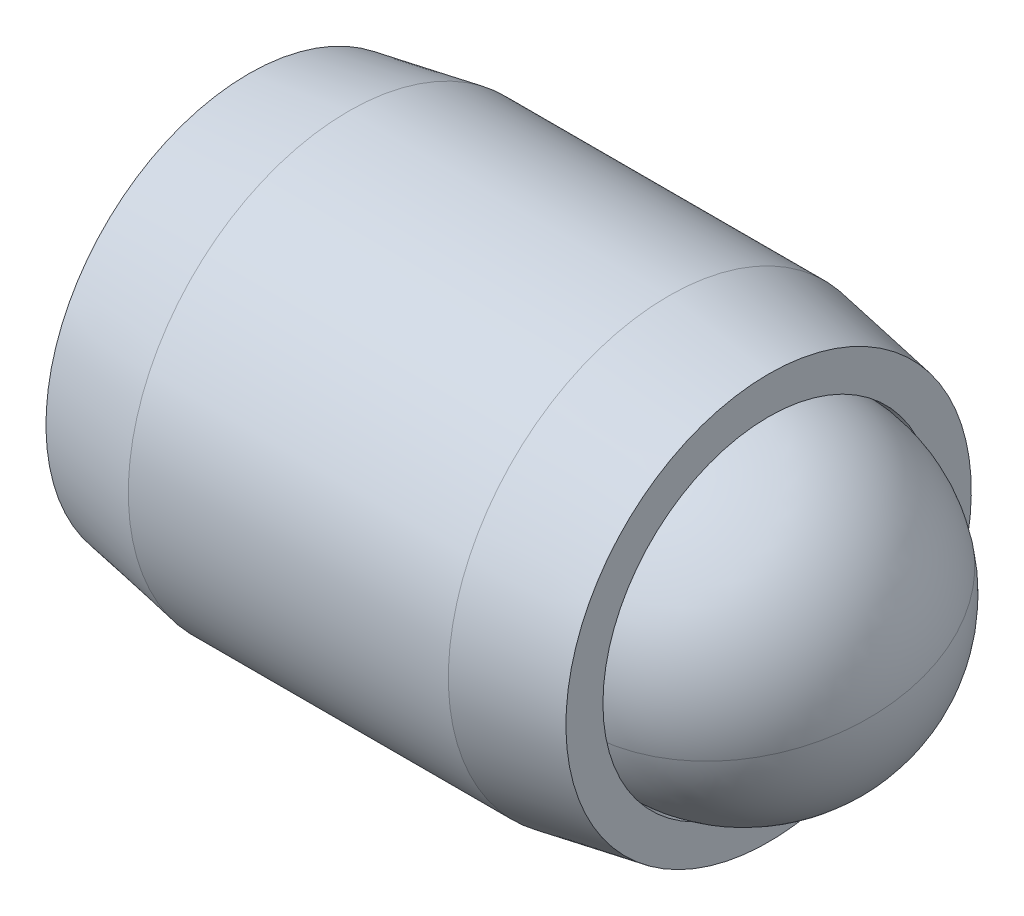
ISO-10303-21;
HEADER;
FILE_DESCRIPTION(('STEP AP214'),'2;1');
FILE_NAME('part.step','',(''),(''),'','','');
FILE_SCHEMA(('AUTOMOTIVE_DESIGN { 1 0 10303 214 1 1 1 1 }'));
ENDSEC;
DATA;
#1=APPLICATION_CONTEXT('core data for automotive mechanical design processes');
#2=APPLICATION_PROTOCOL_DEFINITION('international standard','automotive_design',2000,#1);
#3=PRODUCT_CONTEXT('',#1,'mechanical');
#4=PRODUCT('Part','Part','',(#3));
#5=PRODUCT_RELATED_PRODUCT_CATEGORY('part','',(#4));
#6=PRODUCT_DEFINITION_FORMATION('','',#4);
#7=PRODUCT_DEFINITION_CONTEXT('part definition',#1,'design');
#8=PRODUCT_DEFINITION('design','',#6,#7);
#9=PRODUCT_DEFINITION_SHAPE('','',#8);
#10=(LENGTH_UNIT() NAMED_UNIT(*) SI_UNIT(.MILLI.,.METRE.));
#11=(NAMED_UNIT(*) PLANE_ANGLE_UNIT() SI_UNIT($,.RADIAN.));
#12=(NAMED_UNIT(*) SI_UNIT($,.STERADIAN.) SOLID_ANGLE_UNIT());
#13=UNCERTAINTY_MEASURE_WITH_UNIT(LENGTH_MEASURE(1.E-05),#10,'distance_accuracy_value','');
#14=(GEOMETRIC_REPRESENTATION_CONTEXT(3) GLOBAL_UNCERTAINTY_ASSIGNED_CONTEXT((#13)) GLOBAL_UNIT_ASSIGNED_CONTEXT((#10,
#11,#12)) REPRESENTATION_CONTEXT('',''));
#15=CARTESIAN_POINT('',(0.,0.,0.));
#16=DIRECTION('',(0.,0.,1.));
#17=DIRECTION('',(1.,0.,0.));
#18=AXIS2_PLACEMENT_3D('',#15,#16,#17);
#19=CARTESIAN_POINT('',(-6.46384594701911,2.7420499882851,-0.965131231055238));
#20=DIRECTION('',(-1.,0.,0.));
#21=DIRECTION('',(0.,-1.,0.));
#22=AXIS2_PLACEMENT_3D('',#19,#20,#21);
#23=PLANE('',#22);
#24=DIRECTION('',(0.,0.866025403784439,-0.5));
#25=VECTOR('',#24,1.);
#26=CARTESIAN_POINT('',(-6.46384594701911,2.61504998828509,-2.33078112403965));
#27=LINE('',#26,#25);
#28=CARTESIAN_POINT('',(-6.46384594701911,1.49586248828509,-1.68461791964099));
#29=VERTEX_POINT('',#28);
#30=CARTESIAN_POINT('',(-6.46384594701911,2.74204998828509,-2.40410460822673));
#31=VERTEX_POINT('',#30);
#32=EDGE_CURVE('P0_E164',#29,#31,#27,.T.);
#33=ORIENTED_EDGE('',*,*,#32,.T.);
#34=DIRECTION('',(0.,0.866025403784439,0.5));
#35=VECTOR('',#34,1.);
#36=CARTESIAN_POINT('',(-6.46384594701911,3.8612374882851,-1.75794140382807));
#37=LINE('',#36,#35);
#38=CARTESIAN_POINT('',(-6.46384594701911,3.9882374882851,-1.68461791964099));
#39=VERTEX_POINT('',#38);
#40=EDGE_CURVE('P0_E166',#31,#39,#37,.T.);
#41=ORIENTED_EDGE('',*,*,#40,.T.);
#42=DIRECTION('',(0.,0.,1.));
#43=VECTOR('',#42,1.);
#44=CARTESIAN_POINT('',(-6.46384594701911,3.9882374882851,-0.392291510843657));
#45=LINE('',#44,#43);
#46=CARTESIAN_POINT('',(-6.46384594701911,3.9882374882851,-0.245644542469491));
#47=VERTEX_POINT('',#46);
#48=EDGE_CURVE('P0_E156',#39,#47,#45,.T.);
#49=ORIENTED_EDGE('',*,*,#48,.T.);
#50=DIRECTION('',(0.,-0.866025403784438,0.5));
#51=VECTOR('',#50,1.);
#52=CARTESIAN_POINT('',(-6.46384594701911,2.8690499882851,0.400518661929173));
#53=LINE('',#52,#51);
#54=CARTESIAN_POINT('',(-6.46384594701911,2.7420499882851,0.473842146116256));
#55=VERTEX_POINT('',#54);
#56=EDGE_CURVE('P0_E158',#47,#55,#53,.T.);
#57=ORIENTED_EDGE('',*,*,#56,.T.);
#58=DIRECTION('',(0.,-0.866025403784439,-0.499999999999999));
#59=VECTOR('',#58,1.);
#60=CARTESIAN_POINT('',(-6.46384594701911,1.62286248828509,-0.172321058282408));
#61=LINE('',#60,#59);
#62=CARTESIAN_POINT('',(-6.46384594701911,1.49586248828509,-0.245644542469491));
#63=VERTEX_POINT('',#62);
#64=EDGE_CURVE('P0_E160',#55,#63,#61,.T.);
#65=ORIENTED_EDGE('',*,*,#64,.T.);
#66=DIRECTION('',(0.,0.,-1.));
#67=VECTOR('',#66,1.);
#68=CARTESIAN_POINT('',(-6.46384594701911,1.49586248828509,-1.53797095126682));
#69=LINE('',#68,#67);
#70=EDGE_CURVE('P0_E162',#63,#29,#69,.T.);
#71=ORIENTED_EDGE('',*,*,#70,.T.);
#72=EDGE_LOOP('',(#33,#41,#49,#57,#65,#71));
#73=FACE_BOUND('',#72,.T.);
#74=CARTESIAN_POINT('',(-6.46384594701911,2.7420499882851,-0.965131231055238));
#75=DIRECTION('',(1.,0.,0.));
#76=DIRECTION('',(0.,1.,0.));
#77=AXIS2_PLACEMENT_3D('',#74,#75,#76);
#78=CIRCLE('',#77,2.921);
#79=CARTESIAN_POINT('',(-6.46384594701911,5.6630499882851,-0.965131231055238));
#80=VERTEX_POINT('',#79);
#81=EDGE_CURVE('P0_E150',#80,#80,#78,.T.);
#82=ORIENTED_EDGE('',*,*,#81,.F.);
#83=EDGE_LOOP('',(#82));
#84=FACE_BOUND('',#83,.T.);
#85=ADVANCED_FACE('P0_F17',(#73,#84),#23,.T.);
#86=CARTESIAN_POINT('',(-5.02334036483622,2.7420499882851,-0.965131231055238));
#87=DIRECTION('',(1.,0.,0.));
#88=DIRECTION('',(0.,1.,0.));
#89=AXIS2_PLACEMENT_3D('',#86,#87,#88);
#90=CONICAL_SURFACE('',#89,3.175,0.174532925199434);
#91=ORIENTED_EDGE('',*,*,#81,.T.);
#92=EDGE_LOOP('',(#91));
#93=FACE_BOUND('',#92,.T.);
#94=CARTESIAN_POINT('',(-5.02334036483622,2.7420499882851,-0.965131231055238));
#95=DIRECTION('',(1.,0.,0.));
#96=DIRECTION('',(0.,1.,0.));
#97=AXIS2_PLACEMENT_3D('',#94,#95,#96);
#98=CIRCLE('',#97,3.175);
#99=CARTESIAN_POINT('',(-5.02334036483622,5.9170499882851,-0.965131231055238));
#100=VERTEX_POINT('',#99);
#101=EDGE_CURVE('P0_E147',#100,#100,#98,.T.);
#102=ORIENTED_EDGE('',*,*,#101,.F.);
#103=EDGE_LOOP('',(#102));
#104=FACE_BOUND('',#103,.T.);
#105=ADVANCED_FACE('P0_F225',(#93,#104),#90,.T.);
#106=CARTESIAN_POINT('',(-2.68769199242004,2.7420499882851,-0.965131231055238));
#107=DIRECTION('',(1.,0.,0.));
#108=DIRECTION('',(0.,1.,0.));
#109=AXIS2_PLACEMENT_3D('',#106,#107,#108);
#110=CYLINDRICAL_SURFACE('',#109,3.175);
#111=ORIENTED_EDGE('',*,*,#101,.T.);
#112=EDGE_LOOP('',(#111));
#113=FACE_BOUND('',#112,.T.);
#114=CARTESIAN_POINT('',(-0.411351529202001,2.7420499882851,-0.965131231055238));
#115=DIRECTION('',(1.,0.,0.));
#116=DIRECTION('',(0.,1.,0.));
#117=AXIS2_PLACEMENT_3D('',#114,#115,#116);
#118=CIRCLE('',#117,3.175);
#119=CARTESIAN_POINT('',(-0.411351529202002,5.9170499882851,-0.965131231055238));
#120=VERTEX_POINT('',#119);
#121=EDGE_CURVE('P0_E144',#120,#120,#118,.T.);
#122=ORIENTED_EDGE('',*,*,#121,.F.);
#123=EDGE_LOOP('',(#122));
#124=FACE_BOUND('',#123,.T.);
#125=ADVANCED_FACE('P0_F231',(#113,#124),#110,.T.);
#126=CARTESIAN_POINT('',(1.02915405298089,2.7420499882851,-0.965131231055238));
#127=DIRECTION('',(-1.,0.,0.));
#128=DIRECTION('',(0.,-1.,0.));
#129=AXIS2_PLACEMENT_3D('',#126,#127,#128);
#130=CONICAL_SURFACE('',#129,2.921,0.174532925199434);
#131=ORIENTED_EDGE('',*,*,#121,.T.);
#132=EDGE_LOOP('',(#131));
#133=FACE_BOUND('',#132,.T.);
#134=CARTESIAN_POINT('',(1.02915405298089,2.7420499882851,-0.965131231055238));
#135=DIRECTION('',(1.,0.,0.));
#136=DIRECTION('',(0.,1.,0.));
#137=AXIS2_PLACEMENT_3D('',#134,#135,#136);
#138=CIRCLE('',#137,2.921);
#139=CARTESIAN_POINT('',(1.02915405298089,5.6630499882851,-0.965131231055238));
#140=VERTEX_POINT('',#139);
#141=EDGE_CURVE('P0_E141',#140,#140,#138,.T.);
#142=ORIENTED_EDGE('',*,*,#141,.F.);
#143=EDGE_LOOP('',(#142));
#144=FACE_BOUND('',#143,.T.);
#145=ADVANCED_FACE('P0_F275',(#133,#144),#130,.T.);
#146=CARTESIAN_POINT('',(1.02915405298089,5.6630499882851,-0.965131231055238));
#147=DIRECTION('',(1.,0.,0.));
#148=DIRECTION('',(0.,1.,0.));
#149=AXIS2_PLACEMENT_3D('',#146,#147,#148);
#150=PLANE('',#149);
#151=ORIENTED_EDGE('',*,*,#141,.T.);
#152=EDGE_LOOP('',(#151));
#153=FACE_BOUND('',#152,.T.);
#154=CARTESIAN_POINT('',(1.02915405298089,2.7420499882851,-0.965131231055238));
#155=DIRECTION('',(1.,0.,0.));
#156=DIRECTION('',(0.,1.,0.));
#157=AXIS2_PLACEMENT_3D('',#154,#155,#156);
#158=CIRCLE('',#157,2.3876);
#159=CARTESIAN_POINT('',(1.02915405298089,5.1296499882851,-0.965131231055238));
#160=VERTEX_POINT('',#159);
#161=EDGE_CURVE('P0_E138',#160,#160,#158,.T.);
#162=ORIENTED_EDGE('',*,*,#161,.F.);
#163=EDGE_LOOP('',(#162));
#164=FACE_BOUND('',#163,.T.);
#165=ADVANCED_FACE('P0_F271',(#153,#164),#150,.T.);
#166=CARTESIAN_POINT('',(-2.68769199242004,2.7420499882851,-0.965131231055238));
#167=DIRECTION('',(1.,0.,0.));
#168=DIRECTION('',(0.,1.,0.));
#169=AXIS2_PLACEMENT_3D('',#166,#167,#168);
#170=CYLINDRICAL_SURFACE('',#169,2.3876);
#171=ORIENTED_EDGE('',*,*,#161,.T.);
#172=EDGE_LOOP('',(#171));
#173=FACE_BOUND('',#172,.T.);
#174=CARTESIAN_POINT('',(-0.300091992420045,2.7420499882851,-0.965131231055238));
#175=DIRECTION('',(1.,0.,0.));
#176=DIRECTION('',(0.,1.,0.));
#177=AXIS2_PLACEMENT_3D('',#174,#175,#176);
#178=CIRCLE('',#177,2.3876);
#179=CARTESIAN_POINT('',(-0.300091992420045,5.1296499882851,-0.965131231055238));
#180=VERTEX_POINT('',#179);
#181=EDGE_CURVE('P0_E126',#180,#180,#178,.T.);
#182=ORIENTED_EDGE('',*,*,#181,.F.);
#183=EDGE_LOOP('',(#182));
#184=FACE_BOUND('',#183,.T.);
#185=ADVANCED_FACE('P0_F267',(#173,#184),#170,.F.);
#186=CARTESIAN_POINT('',(-2.68769199242004,2.7420499882851,-0.965131231055238));
#187=DIRECTION('',(1.,0.,0.));
#188=DIRECTION('',(0.,1.,0.));
#189=AXIS2_PLACEMENT_3D('',#186,#187,#188);
#190=CONICAL_SURFACE('',#189,0.,0.78539816339745);
#191=ORIENTED_EDGE('',*,*,#181,.T.);
#192=EDGE_LOOP('',(#191));
#193=FACE_BOUND('',#192,.T.);
#194=CARTESIAN_POINT('',(-2.68769199242004,2.7420499882851,-0.965131231055238));
#195=VERTEX_POINT('',#194);
#196=VERTEX_LOOP('',#195);
#197=FACE_BOUND('',#196,.T.);
#198=ADVANCED_FACE('P0_F221',(#193,#197),#190,.F.);
#199=CARTESIAN_POINT('',(-3.41584594701911,2.7420499882851,0.180548209367926));
#200=DIRECTION('',(0.,0.5,0.866025403784438));
#201=DIRECTION('',(0.,-0.866025403784439,0.5));
#202=AXIS2_PLACEMENT_3D('',#199,#200,#201);
#203=PLANE('',#202);
#204=DIRECTION('',(-1.,0.,0.));
#205=VECTOR('',#204,1.);
#206=CARTESIAN_POINT('',(-3.41584594701911,2.7420499882851,0.180548209367926));
#207=LINE('',#206,#205);
#208=CARTESIAN_POINT('',(-3.41584594701911,2.7420499882851,0.180548209367926));
#209=VERTEX_POINT('',#208);
#210=CARTESIAN_POINT('',(-6.20984594701911,2.7420499882851,0.180548209367926));
#211=VERTEX_POINT('',#210);
#212=EDGE_CURVE('P0_E124',#209,#211,#207,.T.);
#213=ORIENTED_EDGE('',*,*,#212,.T.);
#214=DIRECTION('',(0.,0.866025403784439,-0.5));
#215=VECTOR('',#214,1.);
#216=CARTESIAN_POINT('',(-6.20984594701911,3.7342374882851,-0.392291510843657));
#217=LINE('',#216,#215);
#218=CARTESIAN_POINT('',(-6.20984594701911,3.7342374882851,-0.392291510843657));
#219=VERTEX_POINT('',#218);
#220=EDGE_CURVE('P0_E26',#211,#219,#217,.T.);
#221=ORIENTED_EDGE('',*,*,#220,.T.);
#222=DIRECTION('',(-1.,0.,0.));
#223=VECTOR('',#222,1.);
#224=CARTESIAN_POINT('',(-3.41584594701911,3.7342374882851,-0.392291510843657));
#225=LINE('',#224,#223);
#226=CARTESIAN_POINT('',(-3.41584594701911,3.7342374882851,-0.392291510843657));
#227=VERTEX_POINT('',#226);
#228=EDGE_CURVE('P0_E90',#227,#219,#225,.T.);
#229=ORIENTED_EDGE('',*,*,#228,.F.);
#230=DIRECTION('',(0.,0.866025403784438,-0.5));
#231=VECTOR('',#230,1.);
#232=CARTESIAN_POINT('',(-3.41584594701911,2.7420499882851,0.180548209367926));
#233=LINE('',#232,#231);
#234=EDGE_CURVE('P0_E94',#209,#227,#233,.T.);
#235=ORIENTED_EDGE('',*,*,#234,.F.);
#236=EDGE_LOOP('',(#213,#221,#229,#235));
#237=FACE_BOUND('',#236,.T.);
#238=ADVANCED_FACE('P0_F92',(#237),#203,.F.);
#239=CARTESIAN_POINT('',(-3.41584594701911,1.7498624882851,-0.392291510843656));
#240=DIRECTION('',(0.,-0.499999999999999,0.866025403784439));
#241=DIRECTION('',(0.,-0.866025403784439,-0.499999999999999));
#242=AXIS2_PLACEMENT_3D('',#239,#240,#241);
#243=PLANE('',#242);
#244=DIRECTION('',(-1.,0.,0.));
#245=VECTOR('',#244,1.);
#246=CARTESIAN_POINT('',(-3.41584594701911,1.7498624882851,-0.392291510843656));
#247=LINE('',#246,#245);
#248=CARTESIAN_POINT('',(-3.41584594701911,1.7498624882851,-0.392291510843656));
#249=VERTEX_POINT('',#248);
#250=CARTESIAN_POINT('',(-6.20984594701911,1.74986248828509,-0.392291510843656));
#251=VERTEX_POINT('',#250);
#252=EDGE_CURVE('P0_E127',#249,#251,#247,.T.);
#253=ORIENTED_EDGE('',*,*,#252,.T.);
#254=DIRECTION('',(0.,0.866025403784439,0.499999999999999));
#255=VECTOR('',#254,1.);
#256=CARTESIAN_POINT('',(-6.20984594701911,2.7420499882851,0.180548209367925));
#257=LINE('',#256,#255);
#258=EDGE_CURVE('P0_E41',#251,#211,#257,.T.);
#259=ORIENTED_EDGE('',*,*,#258,.T.);
#260=ORIENTED_EDGE('',*,*,#212,.F.);
#261=DIRECTION('',(0.,0.866025403784439,0.499999999999999));
#262=VECTOR('',#261,1.);
#263=CARTESIAN_POINT('',(-3.41584594701911,1.7498624882851,-0.392291510843656));
#264=LINE('',#263,#262);
#265=EDGE_CURVE('P0_E99',#249,#209,#264,.T.);
#266=ORIENTED_EDGE('',*,*,#265,.F.);
#267=EDGE_LOOP('',(#253,#259,#260,#266));
#268=FACE_BOUND('',#267,.T.);
#269=ADVANCED_FACE('P0_F212',(#268),#243,.F.);
#270=CARTESIAN_POINT('',(-3.41584594701911,1.7498624882851,-1.53797095126682));
#271=DIRECTION('',(0.,-1.,0.));
#272=DIRECTION('',(0.,0.,-1.));
#273=AXIS2_PLACEMENT_3D('',#270,#271,#272);
#274=PLANE('',#273);
#275=DIRECTION('',(-1.,0.,0.));
#276=VECTOR('',#275,1.);
#277=CARTESIAN_POINT('',(-3.41584594701911,1.7498624882851,-1.53797095126682));
#278=LINE('',#277,#276);
#279=CARTESIAN_POINT('',(-3.41584594701911,1.7498624882851,-1.53797095126682));
#280=VERTEX_POINT('',#279);
#281=CARTESIAN_POINT('',(-6.20984594701911,1.74986248828509,-1.53797095126682));
#282=VERTEX_POINT('',#281);
#283=EDGE_CURVE('P0_E129',#280,#282,#278,.T.);
#284=ORIENTED_EDGE('',*,*,#283,.T.);
#285=DIRECTION('',(0.,0.,1.));
#286=VECTOR('',#285,1.);
#287=CARTESIAN_POINT('',(-6.20984594701911,1.74986248828509,-0.392291510843656));
#288=LINE('',#287,#286);
#289=EDGE_CURVE('P0_E171',#282,#251,#288,.T.);
#290=ORIENTED_EDGE('',*,*,#289,.T.);
#291=ORIENTED_EDGE('',*,*,#252,.F.);
#292=DIRECTION('',(0.,0.,1.));
#293=VECTOR('',#292,1.);
#294=CARTESIAN_POINT('',(-3.41584594701911,1.7498624882851,-1.53797095126682));
#295=LINE('',#294,#293);
#296=EDGE_CURVE('P0_E121',#280,#249,#295,.T.);
#297=ORIENTED_EDGE('',*,*,#296,.F.);
#298=EDGE_LOOP('',(#284,#290,#291,#297));
#299=FACE_BOUND('',#298,.T.);
#300=ADVANCED_FACE('P0_F211',(#299),#274,.F.);
#301=CARTESIAN_POINT('',(-3.41584594701911,2.7420499882851,-2.1108106714784));
#302=DIRECTION('',(0.,-0.5,-0.866025403784439));
#303=DIRECTION('',(0.,0.866025403784439,-0.5));
#304=AXIS2_PLACEMENT_3D('',#301,#302,#303);
#305=PLANE('',#304);
#306=DIRECTION('',(-1.,0.,0.));
#307=VECTOR('',#306,1.);
#308=CARTESIAN_POINT('',(-3.41584594701911,2.7420499882851,-2.1108106714784));
#309=LINE('',#308,#307);
#310=CARTESIAN_POINT('',(-3.41584594701911,2.7420499882851,-2.1108106714784));
#311=VERTEX_POINT('',#310);
#312=CARTESIAN_POINT('',(-6.20984594701911,2.7420499882851,-2.1108106714784));
#313=VERTEX_POINT('',#312);
#314=EDGE_CURVE('P0_E132',#311,#313,#309,.T.);
#315=ORIENTED_EDGE('',*,*,#314,.T.);
#316=DIRECTION('',(0.,-0.866025403784439,0.5));
#317=VECTOR('',#316,1.);
#318=CARTESIAN_POINT('',(-6.20984594701911,1.74986248828509,-1.53797095126682));
#319=LINE('',#318,#317);
#320=EDGE_CURVE('P0_E169',#313,#282,#319,.T.);
#321=ORIENTED_EDGE('',*,*,#320,.T.);
#322=ORIENTED_EDGE('',*,*,#283,.F.);
#323=DIRECTION('',(0.,-0.866025403784439,0.5));
#324=VECTOR('',#323,1.);
#325=CARTESIAN_POINT('',(-3.41584594701911,2.7420499882851,-2.1108106714784));
#326=LINE('',#325,#324);
#327=EDGE_CURVE('P0_E118',#311,#280,#326,.T.);
#328=ORIENTED_EDGE('',*,*,#327,.F.);
#329=EDGE_LOOP('',(#315,#321,#322,#328));
#330=FACE_BOUND('',#329,.T.);
#331=ADVANCED_FACE('P0_F208',(#330),#305,.F.);
#332=CARTESIAN_POINT('',(-3.41584594701911,3.7342374882851,-1.53797095126682));
#333=DIRECTION('',(0.,0.5,-0.866025403784439));
#334=DIRECTION('',(0.,0.866025403784439,0.5));
#335=AXIS2_PLACEMENT_3D('',#332,#333,#334);
#336=PLANE('',#335);
#337=DIRECTION('',(-1.,0.,0.));
#338=VECTOR('',#337,1.);
#339=CARTESIAN_POINT('',(-3.41584594701911,3.7342374882851,-1.53797095126682));
#340=LINE('',#339,#338);
#341=CARTESIAN_POINT('',(-3.41584594701911,3.7342374882851,-1.53797095126682));
#342=VERTEX_POINT('',#341);
#343=CARTESIAN_POINT('',(-6.20984594701911,3.7342374882851,-1.53797095126682));
#344=VERTEX_POINT('',#343);
#345=EDGE_CURVE('P0_E98',#342,#344,#340,.T.);
#346=ORIENTED_EDGE('',*,*,#345,.T.);
#347=DIRECTION('',(0.,-0.866025403784439,-0.5));
#348=VECTOR('',#347,1.);
#349=CARTESIAN_POINT('',(-6.20984594701911,2.7420499882851,-2.1108106714784));
#350=LINE('',#349,#348);
#351=EDGE_CURVE('P0_E153',#344,#313,#350,.T.);
#352=ORIENTED_EDGE('',*,*,#351,.T.);
#353=ORIENTED_EDGE('',*,*,#314,.F.);
#354=DIRECTION('',(0.,-0.866025403784439,-0.5));
#355=VECTOR('',#354,1.);
#356=CARTESIAN_POINT('',(-3.41584594701911,3.7342374882851,-1.53797095126682));
#357=LINE('',#356,#355);
#358=EDGE_CURVE('P0_E108',#342,#311,#357,.T.);
#359=ORIENTED_EDGE('',*,*,#358,.F.);
#360=EDGE_LOOP('',(#346,#352,#353,#359));
#361=FACE_BOUND('',#360,.T.);
#362=ADVANCED_FACE('P0_F204',(#361),#336,.F.);
#363=CARTESIAN_POINT('',(-3.41584594701911,3.7342374882851,-0.392291510843657));
#364=DIRECTION('',(0.,1.,0.));
#365=DIRECTION('',(0.,0.,1.));
#366=AXIS2_PLACEMENT_3D('',#363,#364,#365);
#367=PLANE('',#366);
#368=ORIENTED_EDGE('',*,*,#228,.T.);
#369=DIRECTION('',(0.,0.,-1.));
#370=VECTOR('',#369,1.);
#371=CARTESIAN_POINT('',(-6.20984594701911,3.7342374882851,-1.53797095126682));
#372=LINE('',#371,#370);
#373=EDGE_CURVE('P0_E11',#219,#344,#372,.T.);
#374=ORIENTED_EDGE('',*,*,#373,.T.);
#375=ORIENTED_EDGE('',*,*,#345,.F.);
#376=DIRECTION('',(0.,0.,-1.));
#377=VECTOR('',#376,1.);
#378=CARTESIAN_POINT('',(-3.41584594701911,3.7342374882851,-0.392291510843657));
#379=LINE('',#378,#377);
#380=EDGE_CURVE('P0_E102',#227,#342,#379,.T.);
#381=ORIENTED_EDGE('',*,*,#380,.F.);
#382=EDGE_LOOP('',(#368,#374,#375,#381));
#383=FACE_BOUND('',#382,.T.);
#384=ADVANCED_FACE('P0_F103',(#383),#367,.F.);
#385=CARTESIAN_POINT('',(-3.41584594701911,4.7264249882851,-0.965131231055239));
#386=DIRECTION('',(-1.,0.,0.));
#387=DIRECTION('',(0.,0.,1.));
#388=AXIS2_PLACEMENT_3D('',#385,#386,#387);
#389=PLANE('',#388);
#390=ORIENTED_EDGE('',*,*,#234,.T.);
#391=ORIENTED_EDGE('',*,*,#380,.T.);
#392=ORIENTED_EDGE('',*,*,#358,.T.);
#393=ORIENTED_EDGE('',*,*,#327,.T.);
#394=ORIENTED_EDGE('',*,*,#296,.T.);
#395=ORIENTED_EDGE('',*,*,#265,.T.);
#396=EDGE_LOOP('',(#390,#391,#392,#393,#394,#395));
#397=FACE_BOUND('',#396,.T.);
#398=ADVANCED_FACE('P0_F110',(#397),#389,.T.);
#399=CARTESIAN_POINT('',(-6.20984594701911,1.7498624882851,-0.392291510843656));
#400=DIRECTION('',(-0.70710678118655,0.353553390593272,-0.612372435695792));
#401=DIRECTION('',(-0.654653670707974,0.,0.755928946018457));
#402=AXIS2_PLACEMENT_3D('',#399,#400,#401);
#403=PLANE('',#402);
#404=DIRECTION('',(-0.654653670707974,-0.654653670707979,0.377964473009229));
#405=VECTOR('',#404,1.);
#406=CARTESIAN_POINT('',(-5.92636380416197,2.03334463114224,-0.555960002332682));
#407=LINE('',#406,#405);
#408=EDGE_CURVE('P0_E115',#63,#251,#407,.F.);
#409=ORIENTED_EDGE('',*,*,#408,.F.);
#410=ORIENTED_EDGE('',*,*,#64,.F.);
#411=DIRECTION('',(-0.654653670707975,0.,0.755928946018457));
#412=VECTOR('',#411,1.);
#413=CARTESIAN_POINT('',(-5.92636380416197,2.7420499882851,-0.146788773610122));
#414=LINE('',#413,#412);
#415=EDGE_CURVE('P0_E21',#211,#55,#414,.T.);
#416=ORIENTED_EDGE('',*,*,#415,.F.);
#417=ORIENTED_EDGE('',*,*,#258,.F.);
#418=EDGE_LOOP('',(#409,#410,#416,#417));
#419=FACE_BOUND('',#418,.T.);
#420=ADVANCED_FACE('P0_F19',(#419),#403,.T.);
#421=CARTESIAN_POINT('',(-6.20984594701911,2.7420499882851,0.180548209367926));
#422=DIRECTION('',(-0.70710678118655,-0.353553390593273,-0.612372435695793));
#423=DIRECTION('',(-0.654653670707975,0.,0.755928946018457));
#424=AXIS2_PLACEMENT_3D('',#421,#422,#423);
#425=PLANE('',#424);
#426=ORIENTED_EDGE('',*,*,#415,.T.);
#427=ORIENTED_EDGE('',*,*,#56,.F.);
#428=DIRECTION('',(-0.654653670707975,0.654653670707979,0.377964473009228));
#429=VECTOR('',#428,1.);
#430=CARTESIAN_POINT('',(-5.92636380416197,3.45075534542795,-0.555960002332681));
#431=LINE('',#430,#429);
#432=EDGE_CURVE('P0_E182',#219,#47,#431,.T.);
#433=ORIENTED_EDGE('',*,*,#432,.F.);
#434=ORIENTED_EDGE('',*,*,#220,.F.);
#435=EDGE_LOOP('',(#426,#427,#433,#434));
#436=FACE_BOUND('',#435,.T.);
#437=ADVANCED_FACE('P0_F196',(#436),#425,.T.);
#438=CARTESIAN_POINT('',(-6.20984594701911,1.74986248828509,-1.53797095126682));
#439=DIRECTION('',(-0.70710678118655,0.707106781186545,0.));
#440=DIRECTION('',(-0.707106781186545,-0.70710678118655,0.));
#441=AXIS2_PLACEMENT_3D('',#438,#439,#440);
#442=PLANE('',#441);
#443=ORIENTED_EDGE('',*,*,#408,.T.);
#444=ORIENTED_EDGE('',*,*,#289,.F.);
#445=DIRECTION('',(-0.654653670707974,-0.654653670707979,-0.377964473009229));
#446=VECTOR('',#445,1.);
#447=CARTESIAN_POINT('',(-5.92636380416197,2.03334463114224,-1.3743024597778));
#448=LINE('',#447,#446);
#449=EDGE_CURVE('P0_E179',#29,#282,#448,.F.);
#450=ORIENTED_EDGE('',*,*,#449,.F.);
#451=ORIENTED_EDGE('',*,*,#70,.F.);
#452=EDGE_LOOP('',(#443,#444,#450,#451));
#453=FACE_BOUND('',#452,.T.);
#454=ADVANCED_FACE('P0_F189',(#453),#442,.T.);
#455=CARTESIAN_POINT('',(-6.20984594701911,3.7342374882851,-0.392291510843657));
#456=DIRECTION('',(-0.70710678118655,-0.707106781186545,0.));
#457=DIRECTION('',(0.707106781186545,-0.70710678118655,0.));
#458=AXIS2_PLACEMENT_3D('',#455,#456,#457);
#459=PLANE('',#458);
#460=ORIENTED_EDGE('',*,*,#432,.T.);
#461=ORIENTED_EDGE('',*,*,#48,.F.);
#462=DIRECTION('',(0.654653670707975,-0.654653670707979,0.377964473009228));
#463=VECTOR('',#462,1.);
#464=CARTESIAN_POINT('',(-6.20984594701911,3.7342374882851,-1.53797095126682));
#465=LINE('',#464,#463);
#466=EDGE_CURVE('P0_E177',#344,#39,#465,.F.);
#467=ORIENTED_EDGE('',*,*,#466,.F.);
#468=ORIENTED_EDGE('',*,*,#373,.F.);
#469=EDGE_LOOP('',(#460,#461,#467,#468));
#470=FACE_BOUND('',#469,.T.);
#471=ADVANCED_FACE('P0_F201',(#470),#459,.T.);
#472=CARTESIAN_POINT('',(-6.20984594701911,2.7420499882851,-2.1108106714784));
#473=DIRECTION('',(-0.707106781186551,0.353553390593272,0.612372435695792));
#474=DIRECTION('',(0.654653670707974,0.,0.755928946018457));
#475=AXIS2_PLACEMENT_3D('',#472,#473,#474);
#476=PLANE('',#475);
#477=ORIENTED_EDGE('',*,*,#449,.T.);
#478=ORIENTED_EDGE('',*,*,#320,.F.);
#479=DIRECTION('',(-0.654653670707975,0.,-0.755928946018457));
#480=VECTOR('',#479,1.);
#481=CARTESIAN_POINT('',(-5.92636380416197,2.7420499882851,-1.78347368850035));
#482=LINE('',#481,#480);
#483=EDGE_CURVE('P0_E175',#31,#313,#482,.F.);
#484=ORIENTED_EDGE('',*,*,#483,.F.);
#485=ORIENTED_EDGE('',*,*,#32,.F.);
#486=EDGE_LOOP('',(#477,#478,#484,#485));
#487=FACE_BOUND('',#486,.T.);
#488=ADVANCED_FACE('P0_F240',(#487),#476,.T.);
#489=CARTESIAN_POINT('',(-6.20984594701911,3.7342374882851,-1.53797095126682));
#490=DIRECTION('',(-0.707106781186549,-0.353553390593273,0.612372435695793));
#491=DIRECTION('',(0.654653670707975,0.,0.755928946018456));
#492=AXIS2_PLACEMENT_3D('',#489,#490,#491);
#493=PLANE('',#492);
#494=ORIENTED_EDGE('',*,*,#466,.T.);
#495=ORIENTED_EDGE('',*,*,#40,.F.);
#496=ORIENTED_EDGE('',*,*,#483,.T.);
#497=ORIENTED_EDGE('',*,*,#351,.F.);
#498=EDGE_LOOP('',(#494,#495,#496,#497));
#499=FACE_BOUND('',#498,.T.);
#500=ADVANCED_FACE('P0_F237',(#499),#493,.T.);
#501=CLOSED_SHELL('',(#85,#105,#125,#145,#165,#185,#198,#238,#269,#300,#331,#362,#384,#398,#420,
#437,#454,#471,#488,#500));
#502=MANIFOLD_SOLID_BREP('P0_B1',#501);
#503=CARTESIAN_POINT('',(0.679904052980888,2.7420499882851,-0.965131231055239));
#504=DIRECTION('',(0.,0.972214232741158,0.234092899626454));
#505=DIRECTION('',(0.,0.234092899626454,-0.972214232741158));
#506=AXIS2_PLACEMENT_3D('',#503,#504,#505);
#507=SPHERICAL_SURFACE('',#506,2.38125);
#508=CARTESIAN_POINT('',(0.679904052980888,2.7420499882851,-0.965131231055239));
#509=DIRECTION('',(1.,0.,0.));
#510=DIRECTION('',(0.,0.234092899626454,-0.972214232741158));
#511=AXIS2_PLACEMENT_3D('',#508,#509,#510);
#512=CIRCLE('',#511,2.38125);
#513=CARTESIAN_POINT('',(0.679904052980888,3.29948370552059,-3.28021637277012));
#514=VERTEX_POINT('',#513);
#515=CARTESIAN_POINT('',(0.679904052980888,2.1846162710496,1.34995391065964));
#516=VERTEX_POINT('',#515);
#517=EDGE_CURVE('P1_E33',#514,#516,#512,.T.);
#518=ORIENTED_EDGE('',*,*,#517,.T.);
#519=CARTESIAN_POINT('',(0.679904052980888,2.7420499882851,-0.965131231055239));
#520=DIRECTION('',(0.,0.972214232741158,0.234092899626454));
#521=DIRECTION('',(1.,0.,0.));
#522=AXIS2_PLACEMENT_3D('',#519,#520,#521);
#523=CIRCLE('',#522,2.38125);
#524=EDGE_CURVE('P1_E10',#516,#514,#523,.T.);
#525=ORIENTED_EDGE('',*,*,#524,.T.);
#526=EDGE_LOOP('',(#518,#525));
#527=FACE_BOUND('',#526,.T.);
#528=ADVANCED_FACE('P1_F16',(#527),#507,.T.);
#529=ORIENTED_EDGE('',*,*,#517,.F.);
#530=CARTESIAN_POINT('',(0.679904052980888,2.7420499882851,-0.965131231055239));
#531=DIRECTION('',(0.,0.972214232741158,0.234092899626454));
#532=DIRECTION('',(1.,0.,0.));
#533=AXIS2_PLACEMENT_3D('',#530,#531,#532);
#534=CIRCLE('',#533,2.38125);
#535=EDGE_CURVE('P1_E23',#514,#516,#534,.T.);
#536=ORIENTED_EDGE('',*,*,#535,.T.);
#537=EDGE_LOOP('',(#529,#536));
#538=FACE_BOUND('',#537,.T.);
#539=ADVANCED_FACE('P1_F40',(#538),#507,.T.);
#540=ORIENTED_EDGE('',*,*,#524,.F.);
#541=EDGE_CURVE('P1_E36',#516,#514,#512,.T.);
#542=ORIENTED_EDGE('',*,*,#541,.T.);
#543=EDGE_LOOP('',(#540,#542));
#544=FACE_BOUND('',#543,.T.);
#545=ADVANCED_FACE('P1_F38',(#544),#507,.T.);
#546=ORIENTED_EDGE('',*,*,#535,.F.);
#547=ORIENTED_EDGE('',*,*,#541,.F.);
#548=EDGE_LOOP('',(#546,#547));
#549=FACE_BOUND('',#548,.T.);
#550=ADVANCED_FACE('P1_F18',(#549),#507,.T.);
#551=CLOSED_SHELL('',(#528,#539,#545,#550));
#552=MANIFOLD_SOLID_BREP('P1_B1',#551);
#553=ADVANCED_BREP_SHAPE_REPRESENTATION('',(#18,#502,#552),#14);
#554=SHAPE_DEFINITION_REPRESENTATION(#9,#553);
ENDSEC;
END-ISO-10303-21;
